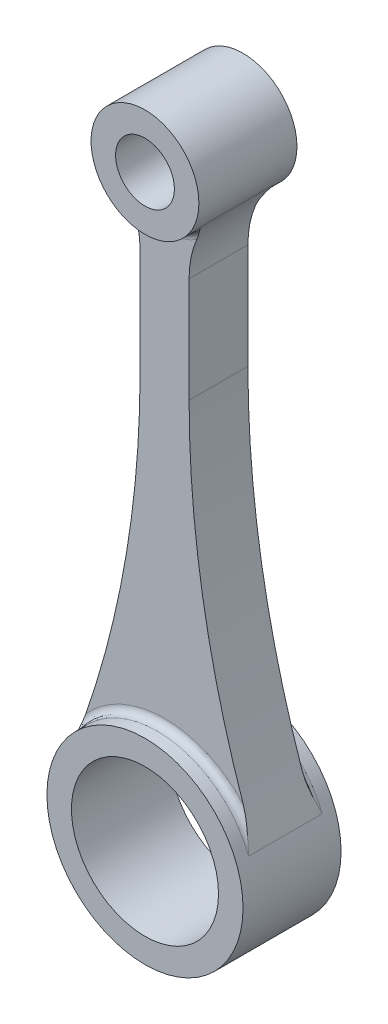
ISO-10303-21;
HEADER;
FILE_DESCRIPTION(('STEP AP214'),'2;1');
FILE_NAME('part.step','',(''),(''),'','','');
FILE_SCHEMA(('AUTOMOTIVE_DESIGN { 1 0 10303 214 1 1 1 1 }'));
ENDSEC;
DATA;
#1=APPLICATION_CONTEXT('core data for automotive mechanical design processes');
#2=APPLICATION_PROTOCOL_DEFINITION('international standard','automotive_design',2000,#1);
#3=PRODUCT_CONTEXT('',#1,'mechanical');
#4=PRODUCT('Part','Part','',(#3));
#5=PRODUCT_RELATED_PRODUCT_CATEGORY('part','',(#4));
#6=PRODUCT_DEFINITION_FORMATION('','',#4);
#7=PRODUCT_DEFINITION_CONTEXT('part definition',#1,'design');
#8=PRODUCT_DEFINITION('design','',#6,#7);
#9=PRODUCT_DEFINITION_SHAPE('','',#8);
#10=(LENGTH_UNIT() NAMED_UNIT(*) SI_UNIT(.MILLI.,.METRE.));
#11=(NAMED_UNIT(*) PLANE_ANGLE_UNIT() SI_UNIT($,.RADIAN.));
#12=(NAMED_UNIT(*) SI_UNIT($,.STERADIAN.) SOLID_ANGLE_UNIT());
#13=UNCERTAINTY_MEASURE_WITH_UNIT(LENGTH_MEASURE(1.E-05),#10,'distance_accuracy_value','');
#14=(GEOMETRIC_REPRESENTATION_CONTEXT(3) GLOBAL_UNCERTAINTY_ASSIGNED_CONTEXT((#13)) GLOBAL_UNIT_ASSIGNED_CONTEXT((#10,
#11,#12)) REPRESENTATION_CONTEXT('',''));
#15=CARTESIAN_POINT('',(0.,0.,0.));
#16=DIRECTION('',(0.,0.,1.));
#17=DIRECTION('',(1.,0.,0.));
#18=AXIS2_PLACEMENT_3D('',#15,#16,#17);
#19=CARTESIAN_POINT('',(0.,0.,10.));
#20=DIRECTION('',(0.,0.,1.));
#21=DIRECTION('',(1.,0.,0.));
#22=AXIS2_PLACEMENT_3D('',#19,#20,#21);
#23=PLANE('',#22);
#24=CARTESIAN_POINT('',(0.,0.,10.));
#25=DIRECTION('',(0.,0.,1.));
#26=DIRECTION('',(1.,0.,0.));
#27=AXIS2_PLACEMENT_3D('',#24,#25,#26);
#28=CIRCLE('',#27,20.);
#29=CARTESIAN_POINT('',(20.,0.,10.));
#30=VERTEX_POINT('',#29);
#31=EDGE_CURVE('E200',#30,#30,#28,.T.);
#32=ORIENTED_EDGE('',*,*,#31,.T.);
#33=EDGE_LOOP('',(#32));
#34=FACE_BOUND('',#33,.T.);
#35=CARTESIAN_POINT('',(0.,0.,10.));
#36=DIRECTION('',(0.,0.,1.));
#37=DIRECTION('',(1.,0.,0.));
#38=AXIS2_PLACEMENT_3D('',#35,#36,#37);
#39=CIRCLE('',#38,15.);
#40=CARTESIAN_POINT('',(15.,0.,10.));
#41=VERTEX_POINT('',#40);
#42=EDGE_CURVE('E192',#41,#41,#39,.T.);
#43=ORIENTED_EDGE('',*,*,#42,.F.);
#44=EDGE_LOOP('',(#43));
#45=FACE_BOUND('',#44,.T.);
#46=ADVANCED_FACE('F41',(#34,#45),#23,.T.);
#47=CARTESIAN_POINT('',(0.,0.,-10.));
#48=DIRECTION('',(0.,0.,1.));
#49=DIRECTION('',(1.,0.,0.));
#50=AXIS2_PLACEMENT_3D('',#47,#48,#49);
#51=PLANE('',#50);
#52=CARTESIAN_POINT('',(0.,0.,-10.));
#53=DIRECTION('',(0.,0.,1.));
#54=DIRECTION('',(1.,0.,0.));
#55=AXIS2_PLACEMENT_3D('',#52,#53,#54);
#56=CIRCLE('',#55,20.);
#57=CARTESIAN_POINT('',(20.,0.,-10.));
#58=VERTEX_POINT('',#57);
#59=EDGE_CURVE('E196',#58,#58,#56,.T.);
#60=ORIENTED_EDGE('',*,*,#59,.F.);
#61=EDGE_LOOP('',(#60));
#62=FACE_BOUND('',#61,.T.);
#63=CARTESIAN_POINT('',(0.,0.,-10.));
#64=DIRECTION('',(0.,0.,1.));
#65=DIRECTION('',(1.,0.,0.));
#66=AXIS2_PLACEMENT_3D('',#63,#64,#65);
#67=CIRCLE('',#66,15.);
#68=CARTESIAN_POINT('',(15.,0.,-10.));
#69=VERTEX_POINT('',#68);
#70=EDGE_CURVE('E155',#69,#69,#67,.T.);
#71=ORIENTED_EDGE('',*,*,#70,.T.);
#72=EDGE_LOOP('',(#71));
#73=FACE_BOUND('',#72,.T.);
#74=ADVANCED_FACE('F379',(#62,#73),#51,.F.);
#75=CARTESIAN_POINT('',(0.,0.,10.));
#76=DIRECTION('',(0.,0.,-1.));
#77=DIRECTION('',(-1.,0.,0.));
#78=AXIS2_PLACEMENT_3D('',#75,#76,#77);
#79=CYLINDRICAL_SURFACE('',#78,20.);
#80=CARTESIAN_POINT('',(0.,0.,-7.5));
#81=DIRECTION('',(0.,0.,1.));
#82=DIRECTION('',(1.,0.,0.));
#83=AXIS2_PLACEMENT_3D('',#80,#81,#82);
#84=CIRCLE('',#83,20.);
#85=CARTESIAN_POINT('',(-18.6481142651053,7.22826634509114,-7.5));
#86=VERTEX_POINT('',#85);
#87=CARTESIAN_POINT('',(18.6481142651053,7.22826634509119,-7.5));
#88=VERTEX_POINT('',#87);
#89=EDGE_CURVE('E227',#86,#88,#84,.F.);
#90=ORIENTED_EDGE('',*,*,#89,.T.);
#91=DIRECTION('',(0.,0.,-1.));
#92=VECTOR('',#91,1.);
#93=CARTESIAN_POINT('',(18.6481142651053,7.22826634509119,6.));
#94=LINE('',#93,#92);
#95=CARTESIAN_POINT('',(18.6481142651053,7.22826634509119,7.5));
#96=VERTEX_POINT('',#95);
#97=EDGE_CURVE('E187',#96,#88,#94,.T.);
#98=ORIENTED_EDGE('',*,*,#97,.F.);
#99=CARTESIAN_POINT('',(0.,0.,7.5));
#100=DIRECTION('',(0.,0.,1.));
#101=DIRECTION('',(1.,0.,0.));
#102=AXIS2_PLACEMENT_3D('',#99,#100,#101);
#103=CIRCLE('',#102,20.);
#104=CARTESIAN_POINT('',(-18.6481142651053,7.22826634509114,7.5));
#105=VERTEX_POINT('',#104);
#106=EDGE_CURVE('E223',#96,#105,#103,.T.);
#107=ORIENTED_EDGE('',*,*,#106,.T.);
#108=DIRECTION('',(0.,0.,-1.));
#109=VECTOR('',#108,1.);
#110=CARTESIAN_POINT('',(-18.6481142651053,7.22826634509114,6.));
#111=LINE('',#110,#109);
#112=EDGE_CURVE('E156',#105,#86,#111,.T.);
#113=ORIENTED_EDGE('',*,*,#112,.T.);
#114=EDGE_LOOP('',(#90,#98,#107,#113));
#115=FACE_BOUND('',#114,.T.);
#116=ORIENTED_EDGE('',*,*,#31,.F.);
#117=EDGE_LOOP('',(#116));
#118=FACE_BOUND('',#117,.T.);
#119=ORIENTED_EDGE('',*,*,#59,.T.);
#120=EDGE_LOOP('',(#119));
#121=FACE_BOUND('',#120,.T.);
#122=ADVANCED_FACE('F313',(#115,#118,#121),#79,.T.);
#123=CARTESIAN_POINT('',(0.,0.,10.));
#124=DIRECTION('',(0.,0.,-1.));
#125=DIRECTION('',(-1.,0.,0.));
#126=AXIS2_PLACEMENT_3D('',#123,#124,#125);
#127=CYLINDRICAL_SURFACE('',#126,15.);
#128=ORIENTED_EDGE('',*,*,#42,.T.);
#129=EDGE_LOOP('',(#128));
#130=FACE_BOUND('',#129,.T.);
#131=ORIENTED_EDGE('',*,*,#70,.F.);
#132=EDGE_LOOP('',(#131));
#133=FACE_BOUND('',#132,.T.);
#134=ADVANCED_FACE('F378',(#130,#133),#127,.F.);
#135=CARTESIAN_POINT('',(-5.,110.202041028867,6.));
#136=DIRECTION('',(1.,0.,0.));
#137=DIRECTION('',(0.,1.,0.));
#138=AXIS2_PLACEMENT_3D('',#135,#136,#137);
#139=PLANE('',#138);
#140=DIRECTION('',(0.,-1.,0.));
#141=VECTOR('',#140,1.);
#142=CARTESIAN_POINT('',(-5.,110.202041028867,6.));
#143=LINE('',#142,#141);
#144=CARTESIAN_POINT('',(-5.,101.669697220177,6.));
#145=VERTEX_POINT('',#144);
#146=CARTESIAN_POINT('',(-5.00000000000003,80.2020410288673,6.));
#147=VERTEX_POINT('',#146);
#148=EDGE_CURVE('E131',#145,#147,#143,.T.);
#149=ORIENTED_EDGE('',*,*,#148,.F.);
#150=DIRECTION('',(0.,0.,1.));
#151=VECTOR('',#150,1.);
#152=CARTESIAN_POINT('',(-5.,101.669697220177,-7.5));
#153=LINE('',#152,#151);
#154=CARTESIAN_POINT('',(-5.,101.669697220177,-6.));
#155=VERTEX_POINT('',#154);
#156=EDGE_CURVE('E347',#145,#155,#153,.F.);
#157=ORIENTED_EDGE('',*,*,#156,.T.);
#158=DIRECTION('',(0.,-1.,0.));
#159=VECTOR('',#158,1.);
#160=CARTESIAN_POINT('',(-5.,110.202041028867,-6.));
#161=LINE('',#160,#159);
#162=CARTESIAN_POINT('',(-5.00000000000003,80.2020410288673,-6.));
#163=VERTEX_POINT('',#162);
#164=EDGE_CURVE('E150',#155,#163,#161,.T.);
#165=ORIENTED_EDGE('',*,*,#164,.T.);
#166=DIRECTION('',(0.,0.,-1.));
#167=VECTOR('',#166,1.);
#168=CARTESIAN_POINT('',(-5.00000000000003,80.2020410288673,6.));
#169=LINE('',#168,#167);
#170=EDGE_CURVE('E147',#147,#163,#169,.T.);
#171=ORIENTED_EDGE('',*,*,#170,.F.);
#172=EDGE_LOOP('',(#149,#157,#165,#171));
#173=FACE_BOUND('',#172,.T.);
#174=ADVANCED_FACE('F148',(#173),#139,.F.);
#175=CARTESIAN_POINT('',(-206.912246173204,80.2020410288673,6.));
#176=DIRECTION('',(0.,0.,-1.));
#177=DIRECTION('',(-1.,0.,0.));
#178=AXIS2_PLACEMENT_3D('',#175,#176,#177);
#179=CYLINDRICAL_SURFACE('',#178,201.912246173204);
#180=CARTESIAN_POINT('',(-206.912246173204,80.2020410288673,-6.));
#181=DIRECTION('',(0.,0.,-1.));
#182=DIRECTION('',(-1.,0.,0.));
#183=AXIS2_PLACEMENT_3D('',#180,#181,#182);
#184=CIRCLE('',#183,201.912246173204);
#185=CARTESIAN_POINT('',(-16.0593915870727,14.2949621144324,-6.));
#186=VERTEX_POINT('',#185);
#187=EDGE_CURVE('E174',#163,#186,#184,.T.);
#188=ORIENTED_EDGE('',*,*,#187,.T.);
#189=CARTESIAN_POINT('',(-16.0593915870727,14.2949621144324,-6.));
#190=CARTESIAN_POINT('',(-16.1006536952664,14.1754753958459,-6.00001602232113));
#191=CARTESIAN_POINT('',(-16.1420221672796,14.0560452300237,-6.00236364174544));
#192=CARTESIAN_POINT('',(-16.2249250693904,13.8174294281531,-6.01122841546119));
#193=CARTESIAN_POINT('',(-16.2664594535388,13.6982437365971,-6.01774448543607));
#194=CARTESIAN_POINT('',(-16.3496188353405,13.4603293139363,-6.03444296750542));
#195=CARTESIAN_POINT('',(-16.391243663786,13.3416002055135,-6.04462095780505));
#196=CARTESIAN_POINT('',(-16.4746143558791,13.1045050433084,-6.06824871526144));
#197=CARTESIAN_POINT('',(-16.5163602282232,12.986139016936,-6.08169872356126));
#198=CARTESIAN_POINT('',(-16.641358281647,12.6327683299821,-6.12627700219501));
#199=CARTESIAN_POINT('',(-16.7247668152734,12.398358504785,-6.16172009800619));
#200=CARTESIAN_POINT('',(-16.8919587539821,11.931204626075,-6.24186223068263));
#201=CARTESIAN_POINT('',(-16.9757422854815,11.6984612159039,-6.28656466186996));
#202=CARTESIAN_POINT('',(-17.1890070534449,11.1094074843414,-6.40949821500726));
#203=CARTESIAN_POINT('',(-17.3187304550138,10.7542484759823,-6.49279850831259));
#204=CARTESIAN_POINT('',(-17.5791415039694,10.0474088872049,-6.67147800946927));
#205=CARTESIAN_POINT('',(-17.7098291679297,9.69572836681878,-6.7668574253928));
#206=CARTESIAN_POINT('',(-18.1041013686526,8.64365924994487,-7.0646976740192));
#207=CARTESIAN_POINT('',(-18.3695278193184,7.94725690795027,-7.27862120671332));
#208=CARTESIAN_POINT('',(-18.6418666749913,7.24438596708827,-7.49503656019151));
#209=CARTESIAN_POINT('',(-18.6449902140359,7.23632605190532,-7.49751829132709));
#210=CARTESIAN_POINT('',(-18.6481142651053,7.22826634509112,-7.5));
#211=B_SPLINE_CURVE_WITH_KNOTS('',3,(#189,#190,#191,#192,#193,#194,#195,#196,#197,#198,#199,
#200,#201,#202,#203,#204,#205,#206,#207,#208,#209,#210),.UNSPECIFIED.,.F.,.F.,(4,2,2,2,2,2,2,2,
2,2,4),(0.,0.379183324237788,0.758268053646205,1.1368965634233,1.51555298604193,2.2692610382197,
3.02324587808531,4.18443837654468,5.34565088015976,7.67138597053305,7.69836558191354),.UNSPECIFIED.);
#212=EDGE_CURVE('E240',#186,#86,#211,.T.);
#213=ORIENTED_EDGE('',*,*,#212,.T.);
#214=ORIENTED_EDGE('',*,*,#112,.F.);
#215=CARTESIAN_POINT('',(-16.0593915870727,14.2949621144324,6.));
#216=CARTESIAN_POINT('',(-16.1006536952664,14.1754753958459,6.00001602232113));
#217=CARTESIAN_POINT('',(-16.1420221672796,14.0560452300237,6.00236364174543));
#218=CARTESIAN_POINT('',(-16.2249250693904,13.8174294281531,6.01122841546119));
#219=CARTESIAN_POINT('',(-16.2664594535388,13.6982437365971,6.01774448543607));
#220=CARTESIAN_POINT('',(-16.3496188353405,13.4603293139363,6.03444296750542));
#221=CARTESIAN_POINT('',(-16.391243663786,13.3416002055135,6.04462095780505));
#222=CARTESIAN_POINT('',(-16.4746143558791,13.1045050433084,6.06824871526143));
#223=CARTESIAN_POINT('',(-16.5163602282232,12.986139016936,6.08169872356126));
#224=CARTESIAN_POINT('',(-16.641358281647,12.6327683299821,6.12627700219501));
#225=CARTESIAN_POINT('',(-16.7247668152734,12.398358504785,6.16172009800618));
#226=CARTESIAN_POINT('',(-16.8919587539821,11.931204626075,6.24186223068263));
#227=CARTESIAN_POINT('',(-16.9757422854815,11.6984612159039,6.28656466186996));
#228=CARTESIAN_POINT('',(-17.1890070534449,11.1094074843414,6.40949821500726));
#229=CARTESIAN_POINT('',(-17.3187304550138,10.7542484759823,6.49279850831259));
#230=CARTESIAN_POINT('',(-17.5791415039694,10.0474088872049,6.67147800946927));
#231=CARTESIAN_POINT('',(-17.7098291679297,9.69572836681878,6.7668574253928));
#232=CARTESIAN_POINT('',(-18.1041013686526,8.64365924994487,7.06469767401919));
#233=CARTESIAN_POINT('',(-18.3695278193184,7.94725690795027,7.27862120671332));
#234=CARTESIAN_POINT('',(-18.6418666749913,7.24438596708827,7.49503656019151));
#235=CARTESIAN_POINT('',(-18.6449902140359,7.23632605190532,7.49751829132709));
#236=CARTESIAN_POINT('',(-18.6481142651053,7.22826634509112,7.5));
#237=B_SPLINE_CURVE_WITH_KNOTS('',3,(#215,#216,#217,#218,#219,#220,#221,#222,#223,#224,#225,
#226,#227,#228,#229,#230,#231,#232,#233,#234,#235,#236),.UNSPECIFIED.,.F.,.F.,(4,2,2,2,2,2,2,2,
2,2,4),(0.,0.379183324237788,0.758268053646205,1.1368965634233,1.51555298604193,2.2692610382197,
3.02324587808531,4.18443837654468,5.34565088015976,7.67138597053305,7.69836558191354),.UNSPECIFIED.);
#238=CARTESIAN_POINT('',(-16.0593915870727,14.2949621144324,6.));
#239=VERTEX_POINT('',#238);
#240=EDGE_CURVE('E160',#105,#239,#237,.F.);
#241=ORIENTED_EDGE('',*,*,#240,.T.);
#242=CARTESIAN_POINT('',(-206.912246173204,80.2020410288673,6.));
#243=DIRECTION('',(0.,0.,-1.));
#244=DIRECTION('',(-1.,0.,0.));
#245=AXIS2_PLACEMENT_3D('',#242,#243,#244);
#246=CIRCLE('',#245,201.912246173204);
#247=EDGE_CURVE('E137',#147,#239,#246,.T.);
#248=ORIENTED_EDGE('',*,*,#247,.F.);
#249=ORIENTED_EDGE('',*,*,#170,.T.);
#250=EDGE_LOOP('',(#188,#213,#214,#241,#248,#249));
#251=FACE_BOUND('',#250,.T.);
#252=ADVANCED_FACE('F158',(#251),#179,.F.);
#253=CARTESIAN_POINT('',(206.912246173204,80.2020410288673,6.));
#254=DIRECTION('',(0.,0.,-1.));
#255=DIRECTION('',(-1.,0.,0.));
#256=AXIS2_PLACEMENT_3D('',#253,#254,#255);
#257=CYLINDRICAL_SURFACE('',#256,201.912246173204);
#258=ORIENTED_EDGE('',*,*,#97,.T.);
#259=CARTESIAN_POINT('',(16.0593915870727,14.2949621144324,-6.));
#260=CARTESIAN_POINT('',(16.1006536952664,14.175475395846,-6.00001602232113));
#261=CARTESIAN_POINT('',(16.1420221672795,14.0560452300239,-6.00236364174543));
#262=CARTESIAN_POINT('',(16.2249250693902,13.8174294281535,-6.01122841546118));
#263=CARTESIAN_POINT('',(16.2664594535386,13.6982437365976,-6.01774448543604));
#264=CARTESIAN_POINT('',(16.3496188353403,13.4603293139369,-6.03444296750537));
#265=CARTESIAN_POINT('',(16.3912436637857,13.3416002055143,-6.04462095780499));
#266=CARTESIAN_POINT('',(16.4746143558787,13.1045050433093,-6.06824871526135));
#267=CARTESIAN_POINT('',(16.5163602282229,12.986139016937,-6.08169872356116));
#268=CARTESIAN_POINT('',(16.6413582816467,12.632768329983,-6.12627700219488));
#269=CARTESIAN_POINT('',(16.7247668152732,12.3983585047857,-6.16172009800605));
#270=CARTESIAN_POINT('',(16.891958753982,11.9312046260754,-6.24186223068257));
#271=CARTESIAN_POINT('',(16.9757422854815,11.6984612159041,-6.28656466186997));
#272=CARTESIAN_POINT('',(17.1890070534449,11.1094074843414,-6.40949821500719));
#273=CARTESIAN_POINT('',(17.3187304550139,10.7542484759822,-6.49279850831224));
#274=CARTESIAN_POINT('',(17.5791415039694,10.047408887205,-6.67147800946961));
#275=CARTESIAN_POINT('',(17.7098291679296,9.69572836681901,-6.76685742539411));
#276=CARTESIAN_POINT('',(18.1041013686528,8.64365924994425,-7.06469767401677));
#277=CARTESIAN_POINT('',(18.3695278193202,7.94725690794695,-7.27862120669962));
#278=CARTESIAN_POINT('',(18.6418666749912,7.2443859670884,-7.49503656019113));
#279=CARTESIAN_POINT('',(18.6449902140359,7.23632605190538,-7.4975182913269));
#280=CARTESIAN_POINT('',(18.6481142651053,7.22826634509112,-7.5));
#281=B_SPLINE_CURVE_WITH_KNOTS('',3,(#259,#260,#261,#262,#263,#264,#265,#266,#267,#268,#269,
#270,#271,#272,#273,#274,#275,#276,#277,#278,#279,#280),.UNSPECIFIED.,.F.,.F.,(4,2,2,2,2,2,2,2,
2,2,4),(0.,0.379183324237473,0.75826805364557,1.13689656342241,1.51555298604079,
2.26926103821917,3.02324587808531,4.18443837654468,5.34565088015992,7.6713859705327,
7.69836558191355),.UNSPECIFIED.);
#282=CARTESIAN_POINT('',(16.0593915870727,14.2949621144324,-6.));
#283=VERTEX_POINT('',#282);
#284=EDGE_CURVE('E231',#88,#283,#281,.F.);
#285=ORIENTED_EDGE('',*,*,#284,.T.);
#286=CARTESIAN_POINT('',(206.912246173204,80.2020410288673,-6.));
#287=DIRECTION('',(0.,0.,-1.));
#288=DIRECTION('',(1.,0.,0.));
#289=AXIS2_PLACEMENT_3D('',#286,#287,#288);
#290=CIRCLE('',#289,201.912246173204);
#291=CARTESIAN_POINT('',(5.,80.2020410288673,-6.));
#292=VERTEX_POINT('',#291);
#293=EDGE_CURVE('E178',#283,#292,#290,.T.);
#294=ORIENTED_EDGE('',*,*,#293,.T.);
#295=DIRECTION('',(0.,0.,-1.));
#296=VECTOR('',#295,1.);
#297=CARTESIAN_POINT('',(5.,80.2020410288673,6.));
#298=LINE('',#297,#296);
#299=CARTESIAN_POINT('',(5.,80.2020410288673,6.));
#300=VERTEX_POINT('',#299);
#301=EDGE_CURVE('E171',#300,#292,#298,.T.);
#302=ORIENTED_EDGE('',*,*,#301,.F.);
#303=CARTESIAN_POINT('',(206.912246173204,80.2020410288673,6.));
#304=DIRECTION('',(0.,0.,-1.));
#305=DIRECTION('',(1.,0.,0.));
#306=AXIS2_PLACEMENT_3D('',#303,#304,#305);
#307=CIRCLE('',#306,201.912246173204);
#308=CARTESIAN_POINT('',(16.0593915870727,14.2949621144324,6.));
#309=VERTEX_POINT('',#308);
#310=EDGE_CURVE('E162',#309,#300,#307,.T.);
#311=ORIENTED_EDGE('',*,*,#310,.F.);
#312=CARTESIAN_POINT('',(16.0593915870727,14.2949621144324,6.));
#313=CARTESIAN_POINT('',(16.1006536952664,14.175475395846,6.00001602232113));
#314=CARTESIAN_POINT('',(16.1420221672795,14.0560452300239,6.00236364174543));
#315=CARTESIAN_POINT('',(16.2249250693902,13.8174294281535,6.01122841546117));
#316=CARTESIAN_POINT('',(16.2664594535386,13.6982437365976,6.01774448543604));
#317=CARTESIAN_POINT('',(16.3496188353403,13.4603293139369,6.03444296750537));
#318=CARTESIAN_POINT('',(16.3912436637857,13.3416002055143,6.04462095780499));
#319=CARTESIAN_POINT('',(16.4746143558787,13.1045050433093,6.06824871526134));
#320=CARTESIAN_POINT('',(16.5163602282229,12.986139016937,6.08169872356116));
#321=CARTESIAN_POINT('',(16.6413582816467,12.632768329983,6.12627700219488));
#322=CARTESIAN_POINT('',(16.7247668152732,12.3983585047857,6.16172009800605));
#323=CARTESIAN_POINT('',(16.891958753982,11.9312046260754,6.24186223068256));
#324=CARTESIAN_POINT('',(16.9757422854815,11.6984612159041,6.28656466186997));
#325=CARTESIAN_POINT('',(17.1890070534449,11.1094074843414,6.40949821500719));
#326=CARTESIAN_POINT('',(17.3187304550139,10.7542484759822,6.49279850831224));
#327=CARTESIAN_POINT('',(17.5791415039694,10.047408887205,6.6714780094696));
#328=CARTESIAN_POINT('',(17.7098291679296,9.69572836681901,6.7668574253941));
#329=CARTESIAN_POINT('',(18.1041013686528,8.64365924994425,7.06469767401677));
#330=CARTESIAN_POINT('',(18.3695278193202,7.94725690794695,7.27862120669962));
#331=CARTESIAN_POINT('',(18.6418666749912,7.2443859670884,7.49503656019112));
#332=CARTESIAN_POINT('',(18.6449902140359,7.23632605190538,7.4975182913269));
#333=CARTESIAN_POINT('',(18.6481142651053,7.22826634509112,7.5));
#334=B_SPLINE_CURVE_WITH_KNOTS('',3,(#312,#313,#314,#315,#316,#317,#318,#319,#320,#321,#322,
#323,#324,#325,#326,#327,#328,#329,#330,#331,#332,#333),.UNSPECIFIED.,.F.,.F.,(4,2,2,2,2,2,2,2,
2,2,4),(0.,0.379183324237473,0.75826805364557,1.13689656342241,1.51555298604079,
2.26926103821917,3.02324587808531,4.18443837654468,5.34565088015992,7.6713859705327,
7.69836558191355),.UNSPECIFIED.);
#335=EDGE_CURVE('E261',#309,#96,#334,.T.);
#336=ORIENTED_EDGE('',*,*,#335,.T.);
#337=EDGE_LOOP('',(#258,#285,#294,#302,#311,#336));
#338=FACE_BOUND('',#337,.T.);
#339=ADVANCED_FACE('F251',(#338),#257,.F.);
#340=CARTESIAN_POINT('',(5.,110.202041028867,6.));
#341=DIRECTION('',(-1.,0.,0.));
#342=DIRECTION('',(0.,-1.,0.));
#343=AXIS2_PLACEMENT_3D('',#340,#341,#342);
#344=PLANE('',#343);
#345=DIRECTION('',(0.,1.,0.));
#346=VECTOR('',#345,1.);
#347=CARTESIAN_POINT('',(5.,110.202041028867,-6.));
#348=LINE('',#347,#346);
#349=CARTESIAN_POINT('',(5.,101.669697220177,-6.));
#350=VERTEX_POINT('',#349);
#351=EDGE_CURVE('E144',#292,#350,#348,.T.);
#352=ORIENTED_EDGE('',*,*,#351,.T.);
#353=DIRECTION('',(0.,0.,1.));
#354=VECTOR('',#353,1.);
#355=CARTESIAN_POINT('',(5.,101.669697220177,7.5));
#356=LINE('',#355,#354);
#357=CARTESIAN_POINT('',(5.,101.669697220177,6.));
#358=VERTEX_POINT('',#357);
#359=EDGE_CURVE('E343',#350,#358,#356,.T.);
#360=ORIENTED_EDGE('',*,*,#359,.T.);
#361=DIRECTION('',(0.,1.,0.));
#362=VECTOR('',#361,1.);
#363=CARTESIAN_POINT('',(5.,110.202041028867,6.));
#364=LINE('',#363,#362);
#365=EDGE_CURVE('E165',#300,#358,#364,.T.);
#366=ORIENTED_EDGE('',*,*,#365,.F.);
#367=ORIENTED_EDGE('',*,*,#301,.T.);
#368=EDGE_LOOP('',(#352,#360,#366,#367));
#369=FACE_BOUND('',#368,.T.);
#370=ADVANCED_FACE('F255',(#369),#344,.F.);
#371=CARTESIAN_POINT('',(0.,120.,6.));
#372=DIRECTION('',(0.,0.,1.));
#373=DIRECTION('',(1.,0.,0.));
#374=AXIS2_PLACEMENT_3D('',#371,#372,#373);
#375=PLANE('',#374);
#376=ORIENTED_EDGE('',*,*,#365,.T.);
#377=CARTESIAN_POINT('',(25.,101.669697220177,6.));
#378=DIRECTION('',(0.,0.,1.));
#379=DIRECTION('',(1.,0.,0.));
#380=AXIS2_PLACEMENT_3D('',#377,#378,#379);
#381=CIRCLE('',#380,20.);
#382=CARTESIAN_POINT('',(6.52976453851341,109.341098786856,6.));
#383=VERTEX_POINT('',#382);
#384=EDGE_CURVE('E304',#358,#383,#381,.F.);
#385=ORIENTED_EDGE('',*,*,#384,.T.);
#386=CARTESIAN_POINT('',(0.,120.,6.));
#387=DIRECTION('',(0.,0.,1.));
#388=DIRECTION('',(1.,0.,0.));
#389=AXIS2_PLACEMENT_3D('',#386,#387,#388);
#390=CIRCLE('',#389,12.5);
#391=CARTESIAN_POINT('',(-6.52976453851341,109.341098786856,6.));
#392=VERTEX_POINT('',#391);
#393=EDGE_CURVE('E57',#383,#392,#390,.F.);
#394=ORIENTED_EDGE('',*,*,#393,.T.);
#395=CARTESIAN_POINT('',(-25.,101.669697220177,6.));
#396=DIRECTION('',(0.,0.,1.));
#397=DIRECTION('',(1.,0.,0.));
#398=AXIS2_PLACEMENT_3D('',#395,#396,#397);
#399=CIRCLE('',#398,20.);
#400=EDGE_CURVE('E11',#392,#145,#399,.F.);
#401=ORIENTED_EDGE('',*,*,#400,.T.);
#402=ORIENTED_EDGE('',*,*,#148,.T.);
#403=ORIENTED_EDGE('',*,*,#247,.T.);
#404=CARTESIAN_POINT('',(0.,0.,6.));
#405=DIRECTION('',(0.,0.,1.));
#406=DIRECTION('',(1.,0.,0.));
#407=AXIS2_PLACEMENT_3D('',#404,#405,#406);
#408=CIRCLE('',#407,21.5);
#409=EDGE_CURVE('E204',#239,#309,#408,.F.);
#410=ORIENTED_EDGE('',*,*,#409,.T.);
#411=ORIENTED_EDGE('',*,*,#310,.T.);
#412=EDGE_LOOP('',(#376,#385,#394,#401,#402,#403,#410,#411));
#413=FACE_BOUND('',#412,.T.);
#414=ADVANCED_FACE('F134',(#413),#375,.T.);
#415=CARTESIAN_POINT('',(0.,120.,-6.));
#416=DIRECTION('',(0.,0.,1.));
#417=DIRECTION('',(1.,0.,0.));
#418=AXIS2_PLACEMENT_3D('',#415,#416,#417);
#419=PLANE('',#418);
#420=ORIENTED_EDGE('',*,*,#164,.F.);
#421=CARTESIAN_POINT('',(-25.,101.669697220177,-6.));
#422=DIRECTION('',(0.,0.,1.));
#423=DIRECTION('',(1.,0.,0.));
#424=AXIS2_PLACEMENT_3D('',#421,#422,#423);
#425=CIRCLE('',#424,20.);
#426=CARTESIAN_POINT('',(-6.52976453851341,109.341098786856,-6.));
#427=VERTEX_POINT('',#426);
#428=EDGE_CURVE('E303',#155,#427,#425,.T.);
#429=ORIENTED_EDGE('',*,*,#428,.T.);
#430=CARTESIAN_POINT('',(0.,120.,-6.));
#431=DIRECTION('',(0.,0.,1.));
#432=DIRECTION('',(1.,0.,0.));
#433=AXIS2_PLACEMENT_3D('',#430,#431,#432);
#434=CIRCLE('',#433,12.5);
#435=CARTESIAN_POINT('',(6.52976453851341,109.341098786856,-6.));
#436=VERTEX_POINT('',#435);
#437=EDGE_CURVE('E65',#427,#436,#434,.T.);
#438=ORIENTED_EDGE('',*,*,#437,.T.);
#439=CARTESIAN_POINT('',(25.,101.669697220177,-6.));
#440=DIRECTION('',(0.,0.,1.));
#441=DIRECTION('',(1.,0.,0.));
#442=AXIS2_PLACEMENT_3D('',#439,#440,#441);
#443=CIRCLE('',#442,20.);
#444=EDGE_CURVE('E350',#436,#350,#443,.T.);
#445=ORIENTED_EDGE('',*,*,#444,.T.);
#446=ORIENTED_EDGE('',*,*,#351,.F.);
#447=ORIENTED_EDGE('',*,*,#293,.F.);
#448=CARTESIAN_POINT('',(0.,0.,-6.));
#449=DIRECTION('',(0.,0.,1.));
#450=DIRECTION('',(1.,0.,0.));
#451=AXIS2_PLACEMENT_3D('',#448,#449,#450);
#452=CIRCLE('',#451,21.5);
#453=EDGE_CURVE('E218',#283,#186,#452,.T.);
#454=ORIENTED_EDGE('',*,*,#453,.T.);
#455=ORIENTED_EDGE('',*,*,#187,.F.);
#456=EDGE_LOOP('',(#420,#429,#438,#445,#446,#447,#454,#455));
#457=FACE_BOUND('',#456,.T.);
#458=ADVANCED_FACE('F332',(#457),#419,.F.);
#459=CARTESIAN_POINT('',(0.,120.,10.));
#460=DIRECTION('',(0.,0.,1.));
#461=DIRECTION('',(1.,0.,0.));
#462=AXIS2_PLACEMENT_3D('',#459,#460,#461);
#463=PLANE('',#462);
#464=CARTESIAN_POINT('',(0.,120.,10.));
#465=DIRECTION('',(0.,0.,1.));
#466=DIRECTION('',(1.,0.,0.));
#467=AXIS2_PLACEMENT_3D('',#464,#465,#466);
#468=CIRCLE('',#467,11.);
#469=CARTESIAN_POINT('',(11.,120.,10.));
#470=VERTEX_POINT('',#469);
#471=EDGE_CURVE('E175',#470,#470,#468,.T.);
#472=ORIENTED_EDGE('',*,*,#471,.T.);
#473=EDGE_LOOP('',(#472));
#474=FACE_BOUND('',#473,.T.);
#475=CARTESIAN_POINT('',(0.,120.,10.));
#476=DIRECTION('',(0.,0.,1.));
#477=DIRECTION('',(1.,0.,0.));
#478=AXIS2_PLACEMENT_3D('',#475,#476,#477);
#479=CIRCLE('',#478,6.);
#480=CARTESIAN_POINT('',(6.,120.,10.));
#481=VERTEX_POINT('',#480);
#482=EDGE_CURVE('E536',#481,#481,#479,.T.);
#483=ORIENTED_EDGE('',*,*,#482,.F.);
#484=EDGE_LOOP('',(#483));
#485=FACE_BOUND('',#484,.T.);
#486=ADVANCED_FACE('F475',(#474,#485),#463,.T.);
#487=CARTESIAN_POINT('',(0.,120.,-10.));
#488=DIRECTION('',(0.,0.,1.));
#489=DIRECTION('',(1.,0.,0.));
#490=AXIS2_PLACEMENT_3D('',#487,#488,#489);
#491=PLANE('',#490);
#492=CARTESIAN_POINT('',(0.,120.,-10.));
#493=DIRECTION('',(0.,0.,1.));
#494=DIRECTION('',(1.,0.,0.));
#495=AXIS2_PLACEMENT_3D('',#492,#493,#494);
#496=CIRCLE('',#495,11.);
#497=CARTESIAN_POINT('',(11.,120.,-10.));
#498=VERTEX_POINT('',#497);
#499=EDGE_CURVE('E531',#498,#498,#496,.T.);
#500=ORIENTED_EDGE('',*,*,#499,.F.);
#501=EDGE_LOOP('',(#500));
#502=FACE_BOUND('',#501,.T.);
#503=CARTESIAN_POINT('',(0.,120.,-10.));
#504=DIRECTION('',(0.,0.,1.));
#505=DIRECTION('',(1.,0.,0.));
#506=AXIS2_PLACEMENT_3D('',#503,#504,#505);
#507=CIRCLE('',#506,6.);
#508=CARTESIAN_POINT('',(6.,120.,-10.));
#509=VERTEX_POINT('',#508);
#510=EDGE_CURVE('E534',#509,#509,#507,.T.);
#511=ORIENTED_EDGE('',*,*,#510,.T.);
#512=EDGE_LOOP('',(#511));
#513=FACE_BOUND('',#512,.T.);
#514=ADVANCED_FACE('F483',(#502,#513),#491,.F.);
#515=CARTESIAN_POINT('',(0.,120.,10.));
#516=DIRECTION('',(0.,0.,-1.));
#517=DIRECTION('',(-1.,0.,0.));
#518=AXIS2_PLACEMENT_3D('',#515,#516,#517);
#519=CYLINDRICAL_SURFACE('',#518,11.);
#520=DIRECTION('',(0.,0.,-1.));
#521=VECTOR('',#520,1.);
#522=CARTESIAN_POINT('',(8.87096774193548,113.495699013611,10.));
#523=LINE('',#522,#521);
#524=CARTESIAN_POINT('',(8.87096774193548,113.495699013611,7.5));
#525=VERTEX_POINT('',#524);
#526=CARTESIAN_POINT('',(8.87096774193548,113.495699013611,-7.5));
#527=VERTEX_POINT('',#526);
#528=EDGE_CURVE('E339',#525,#527,#523,.T.);
#529=ORIENTED_EDGE('',*,*,#528,.T.);
#530=CARTESIAN_POINT('',(0.,120.,-7.5));
#531=DIRECTION('',(0.,0.,1.));
#532=DIRECTION('',(1.,0.,0.));
#533=AXIS2_PLACEMENT_3D('',#530,#531,#532);
#534=CIRCLE('',#533,11.);
#535=CARTESIAN_POINT('',(-8.87096774193548,113.495699013611,-7.5));
#536=VERTEX_POINT('',#535);
#537=EDGE_CURVE('E212',#527,#536,#534,.F.);
#538=ORIENTED_EDGE('',*,*,#537,.T.);
#539=DIRECTION('',(0.,0.,-1.));
#540=VECTOR('',#539,1.);
#541=CARTESIAN_POINT('',(-8.87096774193548,113.495699013611,10.));
#542=LINE('',#541,#540);
#543=CARTESIAN_POINT('',(-8.87096774193548,113.495699013611,7.5));
#544=VERTEX_POINT('',#543);
#545=EDGE_CURVE('E336',#536,#544,#542,.F.);
#546=ORIENTED_EDGE('',*,*,#545,.T.);
#547=CARTESIAN_POINT('',(0.,120.,7.5));
#548=DIRECTION('',(0.,0.,1.));
#549=DIRECTION('',(1.,0.,0.));
#550=AXIS2_PLACEMENT_3D('',#547,#548,#549);
#551=CIRCLE('',#550,11.);
#552=EDGE_CURVE('E215',#544,#525,#551,.T.);
#553=ORIENTED_EDGE('',*,*,#552,.T.);
#554=EDGE_LOOP('',(#529,#538,#546,#553));
#555=FACE_BOUND('',#554,.T.);
#556=ORIENTED_EDGE('',*,*,#471,.F.);
#557=EDGE_LOOP('',(#556));
#558=FACE_BOUND('',#557,.T.);
#559=ORIENTED_EDGE('',*,*,#499,.T.);
#560=EDGE_LOOP('',(#559));
#561=FACE_BOUND('',#560,.T.);
#562=ADVANCED_FACE('F361',(#555,#558,#561),#519,.T.);
#563=CARTESIAN_POINT('',(0.,120.,10.));
#564=DIRECTION('',(0.,0.,-1.));
#565=DIRECTION('',(-1.,0.,0.));
#566=AXIS2_PLACEMENT_3D('',#563,#564,#565);
#567=CYLINDRICAL_SURFACE('',#566,6.);
#568=ORIENTED_EDGE('',*,*,#482,.T.);
#569=EDGE_LOOP('',(#568));
#570=FACE_BOUND('',#569,.T.);
#571=ORIENTED_EDGE('',*,*,#510,.F.);
#572=EDGE_LOOP('',(#571));
#573=FACE_BOUND('',#572,.T.);
#574=ADVANCED_FACE('F311',(#570,#573),#567,.F.);
#575=CARTESIAN_POINT('',(0.,120.,7.5));
#576=DIRECTION('',(0.,0.,1.));
#577=DIRECTION('',(1.,0.,0.));
#578=AXIS2_PLACEMENT_3D('',#575,#576,#577);
#579=TOROIDAL_SURFACE('',#578,12.5,1.5);
#580=ORIENTED_EDGE('',*,*,#393,.F.);
#581=CARTESIAN_POINT('',(6.52976453851342,109.341098786856,6.));
#582=CARTESIAN_POINT('',(6.56118335819641,109.416747920778,6.00000925177807));
#583=CARTESIAN_POINT('',(6.59305602448844,109.492171876018,6.0023116451661));
#584=CARTESIAN_POINT('',(6.65761775350296,109.642380754179,6.01103347793259));
#585=CARTESIAN_POINT('',(6.69030631753718,109.717166031681,6.01745045890379));
#586=CARTESIAN_POINT('',(6.78931397381672,109.939961264201,6.04212441147721));
#587=CARTESIAN_POINT('',(6.85676792440592,110.086874644217,6.06581023051449));
#588=CARTESIAN_POINT('',(6.99350158938833,110.375515680493,6.12436470006712));
#589=CARTESIAN_POINT('',(7.06275434412629,110.517281815676,6.15911205278892));
#590=CARTESIAN_POINT('',(7.20358444297643,110.797247014589,6.237609843105));
#591=CARTESIAN_POINT('',(7.27516380163178,110.935442790441,6.28136826800806));
#592=CARTESIAN_POINT('',(7.46301782611864,111.288135152223,6.40371242923493));
#593=CARTESIAN_POINT('',(7.5809062569468,111.499893338872,6.48768150142461));
#594=CARTESIAN_POINT('',(7.82184465737976,111.915117050018,6.66761005920629));
#595=CARTESIAN_POINT('',(7.94489547396921,112.118581202843,6.7635715175216));
#596=CARTESIAN_POINT('',(8.19678616505615,112.519035660713,6.9632781453498));
#597=CARTESIAN_POINT('',(8.32564406752536,112.716001970417,7.06704833575691));
#598=CARTESIAN_POINT('',(8.58921706524314,113.103908169925,7.27819082606687));
#599=CARTESIAN_POINT('',(8.72393100109296,113.294849239826,7.38556241199955));
#600=CARTESIAN_POINT('',(8.86493484363075,113.487467664242,7.49530812204721));
#601=CARTESIAN_POINT('',(8.86795050956886,113.49158391814,7.49765406358573));
#602=CARTESIAN_POINT('',(8.87096774193548,113.495699013611,7.5));
#603=B_SPLINE_CURVE_WITH_KNOTS('',3,(#581,#582,#583,#584,#585,#586,#587,#588,#589,#590,#591,
#592,#593,#594,#595,#596,#597,#598,#599,#600,#601,#602),.UNSPECIFIED.,.F.,.F.,(4,2,2,2,2,2,2,2,
2,2,4),(0.,0.245656008911888,0.491165378465856,0.980682937116415,1.46500748572368,
1.9497631962069,2.71855630954788,3.48747605468074,4.25897409193335,5.03032007474101,
5.04716854660824),.UNSPECIFIED.);
#604=EDGE_CURVE('E293',#383,#525,#603,.T.);
#605=ORIENTED_EDGE('',*,*,#604,.T.);
#606=ORIENTED_EDGE('',*,*,#552,.F.);
#607=CARTESIAN_POINT('',(-6.52976453851342,109.341098786856,6.));
#608=CARTESIAN_POINT('',(-6.56118335819645,109.416747920779,6.00000925177807));
#609=CARTESIAN_POINT('',(-6.59305602448851,109.492171876019,6.0023116451661));
#610=CARTESIAN_POINT('',(-6.6576177535031,109.642380754179,6.01103347793261));
#611=CARTESIAN_POINT('',(-6.69030631753735,109.717166031682,6.01745045890383));
#612=CARTESIAN_POINT('',(-6.78931397381698,109.939961264202,6.04212441147729));
#613=CARTESIAN_POINT('',(-6.85676792440624,110.086874644218,6.06581023051461));
#614=CARTESIAN_POINT('',(-6.99350158938865,110.375515680494,6.12436470006727));
#615=CARTESIAN_POINT('',(-7.06275434412654,110.517281815677,6.15911205278905));
#616=CARTESIAN_POINT('',(-7.20358444297655,110.797247014589,6.23760984310508));
#617=CARTESIAN_POINT('',(-7.27516380163184,110.935442790441,6.28136826800811));
#618=CARTESIAN_POINT('',(-7.46301782611864,111.288135152223,6.40371242923491));
#619=CARTESIAN_POINT('',(-7.58090625694681,111.499893338873,6.48768150142453));
#620=CARTESIAN_POINT('',(-7.82184465737969,111.915117050018,6.66761005920632));
#621=CARTESIAN_POINT('',(-7.94489547396906,112.118581202842,6.7635715175218));
#622=CARTESIAN_POINT('',(-8.19678616505612,112.519035660713,6.96327814534945));
#623=CARTESIAN_POINT('',(-8.32564406752553,112.716001970417,7.06704833575584));
#624=CARTESIAN_POINT('',(-8.58921706524282,113.103908169925,7.27819082606783));
#625=CARTESIAN_POINT('',(-8.72393100109195,113.294849239825,7.38556241200325));
#626=CARTESIAN_POINT('',(-8.86493484363073,113.487467664242,7.49530812204738));
#627=CARTESIAN_POINT('',(-8.86795050956884,113.49158391814,7.49765406358582));
#628=CARTESIAN_POINT('',(-8.87096774193548,113.495699013611,7.5));
#629=B_SPLINE_CURVE_WITH_KNOTS('',3,(#607,#608,#609,#610,#611,#612,#613,#614,#615,#616,#617,
#618,#619,#620,#621,#622,#623,#624,#625,#626,#627,#628),.UNSPECIFIED.,.F.,.F.,(4,2,2,2,2,2,2,2,
2,2,4),(0.,0.24565600891216,0.491165378466375,0.980682937117319,1.46500748572411,
1.9497631962069,2.71855630954784,3.48747605468048,4.2589740919332,5.03032007474105,
5.04716854660824),.UNSPECIFIED.);
#630=EDGE_CURVE('E51',#544,#392,#629,.F.);
#631=ORIENTED_EDGE('',*,*,#630,.T.);
#632=EDGE_LOOP('',(#580,#605,#606,#631));
#633=FACE_BOUND('',#632,.T.);
#634=ADVANCED_FACE('F306',(#633),#579,.F.);
#635=CARTESIAN_POINT('',(0.,120.,-7.5));
#636=DIRECTION('',(0.,0.,1.));
#637=DIRECTION('',(1.,0.,0.));
#638=AXIS2_PLACEMENT_3D('',#635,#636,#637);
#639=TOROIDAL_SURFACE('',#638,12.5,1.5);
#640=ORIENTED_EDGE('',*,*,#537,.F.);
#641=CARTESIAN_POINT('',(6.52976453851342,109.341098786856,-6.));
#642=CARTESIAN_POINT('',(6.56118335819645,109.416747920779,-6.00000925177807));
#643=CARTESIAN_POINT('',(6.59305602448851,109.492171876019,-6.00231164516611));
#644=CARTESIAN_POINT('',(6.6576177535031,109.642380754179,-6.01103347793262));
#645=CARTESIAN_POINT('',(6.69030631753735,109.717166031682,-6.01745045890383));
#646=CARTESIAN_POINT('',(6.78931397381698,109.939961264202,-6.04212441147729));
#647=CARTESIAN_POINT('',(6.85676792440624,110.086874644218,-6.06581023051461));
#648=CARTESIAN_POINT('',(6.99350158938865,110.375515680494,-6.12436470006728));
#649=CARTESIAN_POINT('',(7.06275434412654,110.517281815677,-6.15911205278905));
#650=CARTESIAN_POINT('',(7.20358444297655,110.797247014589,-6.23760984310508));
#651=CARTESIAN_POINT('',(7.27516380163184,110.935442790441,-6.28136826800811));
#652=CARTESIAN_POINT('',(7.46301782611864,111.288135152223,-6.40371242923491));
#653=CARTESIAN_POINT('',(7.58090625694681,111.499893338873,-6.48768150142453));
#654=CARTESIAN_POINT('',(7.82184465737969,111.915117050018,-6.66761005920632));
#655=CARTESIAN_POINT('',(7.94489547396906,112.118581202842,-6.7635715175218));
#656=CARTESIAN_POINT('',(8.19678616505612,112.519035660713,-6.96327814534945));
#657=CARTESIAN_POINT('',(8.32564406752553,112.716001970417,-7.06704833575584));
#658=CARTESIAN_POINT('',(8.58921706524282,113.103908169925,-7.27819082606783));
#659=CARTESIAN_POINT('',(8.72393100109195,113.294849239825,-7.38556241200325));
#660=CARTESIAN_POINT('',(8.86493484363073,113.487467664242,-7.49530812204738));
#661=CARTESIAN_POINT('',(8.86795050956884,113.49158391814,-7.49765406358582));
#662=CARTESIAN_POINT('',(8.87096774193548,113.495699013611,-7.5));
#663=B_SPLINE_CURVE_WITH_KNOTS('',3,(#641,#642,#643,#644,#645,#646,#647,#648,#649,#650,#651,
#652,#653,#654,#655,#656,#657,#658,#659,#660,#661,#662),.UNSPECIFIED.,.F.,.F.,(4,2,2,2,2,2,2,2,
2,2,4),(0.,0.24565600891216,0.491165378466375,0.980682937117319,1.46500748572411,
1.9497631962069,2.71855630954784,3.48747605468048,4.2589740919332,5.03032007474105,
5.04716854660824),.UNSPECIFIED.);
#664=EDGE_CURVE('E285',#527,#436,#663,.F.);
#665=ORIENTED_EDGE('',*,*,#664,.T.);
#666=ORIENTED_EDGE('',*,*,#437,.F.);
#667=CARTESIAN_POINT('',(-6.52976453851342,109.341098786856,-6.));
#668=CARTESIAN_POINT('',(-6.56118335819641,109.416747920778,-6.00000925177808));
#669=CARTESIAN_POINT('',(-6.59305602448844,109.492171876018,-6.0023116451661));
#670=CARTESIAN_POINT('',(-6.65761775350296,109.642380754179,-6.01103347793259));
#671=CARTESIAN_POINT('',(-6.69030631753717,109.717166031681,-6.01745045890379));
#672=CARTESIAN_POINT('',(-6.78931397381671,109.939961264201,-6.04212441147721));
#673=CARTESIAN_POINT('',(-6.85676792440592,110.086874644217,-6.06581023051449));
#674=CARTESIAN_POINT('',(-6.99350158938833,110.375515680493,-6.12436470006712));
#675=CARTESIAN_POINT('',(-7.06275434412629,110.517281815676,-6.15911205278892));
#676=CARTESIAN_POINT('',(-7.20358444297643,110.797247014589,-6.237609843105));
#677=CARTESIAN_POINT('',(-7.27516380163178,110.935442790441,-6.28136826800806));
#678=CARTESIAN_POINT('',(-7.46301782611864,111.288135152223,-6.40371242923493));
#679=CARTESIAN_POINT('',(-7.5809062569468,111.499893338872,-6.48768150142461));
#680=CARTESIAN_POINT('',(-7.82184465737976,111.915117050018,-6.66761005920629));
#681=CARTESIAN_POINT('',(-7.94489547396921,112.118581202843,-6.76357151752161));
#682=CARTESIAN_POINT('',(-8.19678616505615,112.519035660713,-6.9632781453498));
#683=CARTESIAN_POINT('',(-8.32564406752535,112.716001970417,-7.06704833575691));
#684=CARTESIAN_POINT('',(-8.58921706524313,113.103908169925,-7.27819082606687));
#685=CARTESIAN_POINT('',(-8.72393100109296,113.294849239826,-7.38556241199955));
#686=CARTESIAN_POINT('',(-8.86493484363075,113.487467664242,-7.49530812204721));
#687=CARTESIAN_POINT('',(-8.86795050956886,113.49158391814,-7.49765406358574));
#688=CARTESIAN_POINT('',(-8.87096774193548,113.495699013611,-7.5));
#689=B_SPLINE_CURVE_WITH_KNOTS('',3,(#667,#668,#669,#670,#671,#672,#673,#674,#675,#676,#677,
#678,#679,#680,#681,#682,#683,#684,#685,#686,#687,#688),.UNSPECIFIED.,.F.,.F.,(4,2,2,2,2,2,2,2,
2,2,4),(0.,0.245656008911886,0.491165378465841,0.980682937116414,1.46500748572368,
1.9497631962069,2.71855630954788,3.48747605468074,4.25897409193333,5.03032007474101,
5.04716854660824),.UNSPECIFIED.);
#690=EDGE_CURVE('E322',#427,#536,#689,.T.);
#691=ORIENTED_EDGE('',*,*,#690,.T.);
#692=EDGE_LOOP('',(#640,#665,#666,#691));
#693=FACE_BOUND('',#692,.T.);
#694=ADVANCED_FACE('F310',(#693),#639,.F.);
#695=CARTESIAN_POINT('',(0.,0.,-7.5));
#696=DIRECTION('',(0.,0.,1.));
#697=DIRECTION('',(1.,0.,0.));
#698=AXIS2_PLACEMENT_3D('',#695,#696,#697);
#699=TOROIDAL_SURFACE('',#698,21.5,1.5);
#700=ORIENTED_EDGE('',*,*,#212,.F.);
#701=ORIENTED_EDGE('',*,*,#453,.F.);
#702=ORIENTED_EDGE('',*,*,#284,.F.);
#703=ORIENTED_EDGE('',*,*,#89,.F.);
#704=EDGE_LOOP('',(#700,#701,#702,#703));
#705=FACE_BOUND('',#704,.T.);
#706=ADVANCED_FACE('F247',(#705),#699,.F.);
#707=CARTESIAN_POINT('',(0.,0.,7.5));
#708=DIRECTION('',(0.,0.,1.));
#709=DIRECTION('',(1.,0.,0.));
#710=AXIS2_PLACEMENT_3D('',#707,#708,#709);
#711=TOROIDAL_SURFACE('',#710,21.5,1.5);
#712=ORIENTED_EDGE('',*,*,#240,.F.);
#713=ORIENTED_EDGE('',*,*,#106,.F.);
#714=ORIENTED_EDGE('',*,*,#335,.F.);
#715=ORIENTED_EDGE('',*,*,#409,.F.);
#716=EDGE_LOOP('',(#712,#713,#714,#715));
#717=FACE_BOUND('',#716,.T.);
#718=ADVANCED_FACE('F274',(#717),#711,.F.);
#719=CARTESIAN_POINT('',(25.,101.669697220177,10.));
#720=DIRECTION('',(0.,0.,-1.));
#721=DIRECTION('',(-1.,0.,0.));
#722=AXIS2_PLACEMENT_3D('',#719,#720,#721);
#723=CYLINDRICAL_SURFACE('',#722,20.);
#724=ORIENTED_EDGE('',*,*,#384,.F.);
#725=ORIENTED_EDGE('',*,*,#359,.F.);
#726=ORIENTED_EDGE('',*,*,#444,.F.);
#727=ORIENTED_EDGE('',*,*,#664,.F.);
#728=ORIENTED_EDGE('',*,*,#528,.F.);
#729=ORIENTED_EDGE('',*,*,#604,.F.);
#730=EDGE_LOOP('',(#724,#725,#726,#727,#728,#729));
#731=FACE_BOUND('',#730,.T.);
#732=ADVANCED_FACE('F277',(#731),#723,.F.);
#733=CARTESIAN_POINT('',(-25.,101.669697220177,10.));
#734=DIRECTION('',(0.,0.,-1.));
#735=DIRECTION('',(-1.,0.,0.));
#736=AXIS2_PLACEMENT_3D('',#733,#734,#735);
#737=CYLINDRICAL_SURFACE('',#736,20.);
#738=ORIENTED_EDGE('',*,*,#630,.F.);
#739=ORIENTED_EDGE('',*,*,#545,.F.);
#740=ORIENTED_EDGE('',*,*,#690,.F.);
#741=ORIENTED_EDGE('',*,*,#428,.F.);
#742=ORIENTED_EDGE('',*,*,#156,.F.);
#743=ORIENTED_EDGE('',*,*,#400,.F.);
#744=EDGE_LOOP('',(#738,#739,#740,#741,#742,#743));
#745=FACE_BOUND('',#744,.T.);
#746=ADVANCED_FACE('F43',(#745),#737,.F.);
#747=CLOSED_SHELL('',(#46,#74,#122,#134,#174,#252,#339,#370,#414,#458,#486,#514,#562,#574,#634,
#694,#706,#718,#732,#746));
#748=MANIFOLD_SOLID_BREP('B2',#747);
#749=ADVANCED_BREP_SHAPE_REPRESENTATION('',(#18,#748),#14);
#750=SHAPE_DEFINITION_REPRESENTATION(#9,#749);
ENDSEC;
END-ISO-10303-21;
